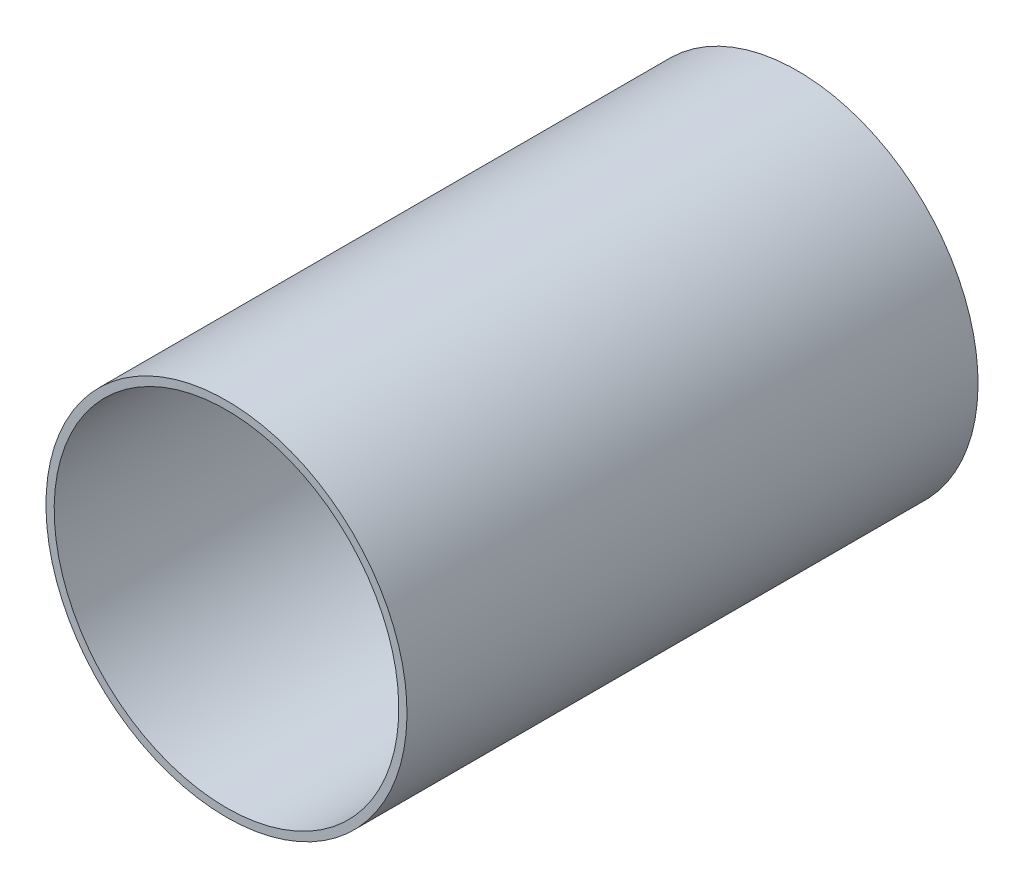
ISO-10303-21;
HEADER;
FILE_DESCRIPTION(('STEP AP214'),'2;1');
FILE_NAME('part.step','',(''),(''),'','','');
FILE_SCHEMA(('AUTOMOTIVE_DESIGN { 1 0 10303 214 1 1 1 1 }'));
ENDSEC;
DATA;
#1=APPLICATION_CONTEXT('core data for automotive mechanical design processes');
#2=APPLICATION_PROTOCOL_DEFINITION('international standard','automotive_design',2000,#1);
#3=PRODUCT_CONTEXT('',#1,'mechanical');
#4=PRODUCT('Part','Part','',(#3));
#5=PRODUCT_RELATED_PRODUCT_CATEGORY('part','',(#4));
#6=PRODUCT_DEFINITION_FORMATION('','',#4);
#7=PRODUCT_DEFINITION_CONTEXT('part definition',#1,'design');
#8=PRODUCT_DEFINITION('design','',#6,#7);
#9=PRODUCT_DEFINITION_SHAPE('','',#8);
#10=(LENGTH_UNIT() NAMED_UNIT(*) SI_UNIT(.MILLI.,.METRE.));
#11=(NAMED_UNIT(*) PLANE_ANGLE_UNIT() SI_UNIT($,.RADIAN.));
#12=(NAMED_UNIT(*) SI_UNIT($,.STERADIAN.) SOLID_ANGLE_UNIT());
#13=UNCERTAINTY_MEASURE_WITH_UNIT(LENGTH_MEASURE(1.E-05),#10,'distance_accuracy_value','');
#14=(GEOMETRIC_REPRESENTATION_CONTEXT(3) GLOBAL_UNCERTAINTY_ASSIGNED_CONTEXT((#13)) GLOBAL_UNIT_ASSIGNED_CONTEXT((#10,
#11,#12)) REPRESENTATION_CONTEXT('',''));
#15=CARTESIAN_POINT('',(0.,0.,0.));
#16=DIRECTION('',(0.,0.,1.));
#17=DIRECTION('',(1.,0.,0.));
#18=AXIS2_PLACEMENT_3D('',#15,#16,#17);
#19=CARTESIAN_POINT('',(149.102,-113.984,-0.045));
#20=DIRECTION('',(0.,0.,-1.));
#21=DIRECTION('',(0.,-1.,0.));
#22=AXIS2_PLACEMENT_3D('',#19,#20,#21);
#23=CYLINDRICAL_SURFACE('',#22,0.525);
#24=CARTESIAN_POINT('',(149.102,-113.984,-0.035));
#25=DIRECTION('',(0.,0.,-1.));
#26=DIRECTION('',(0.,-1.,0.));
#27=AXIS2_PLACEMENT_3D('',#24,#25,#26);
#28=CIRCLE('',#27,0.525);
#29=CARTESIAN_POINT('',(149.102,-114.509,-0.035));
#30=VERTEX_POINT('',#29);
#31=EDGE_CURVE('E64',#30,#30,#28,.T.);
#32=ORIENTED_EDGE('',*,*,#31,.T.);
#33=DIRECTION('',(0.,0.,1.));
#34=VECTOR('',#33,1.);
#35=CARTESIAN_POINT('',(149.102,-114.509,-0.045));
#36=LINE('',#35,#34);
#37=CARTESIAN_POINT('',(149.102,-114.509,1.705));
#38=VERTEX_POINT('',#37);
#39=EDGE_CURVE('E11',#30,#38,#36,.T.);
#40=ORIENTED_EDGE('',*,*,#39,.T.);
#41=CARTESIAN_POINT('',(149.102,-113.984,1.705));
#42=DIRECTION('',(0.,0.,-1.));
#43=DIRECTION('',(0.,-1.,0.));
#44=AXIS2_PLACEMENT_3D('',#41,#42,#43);
#45=CIRCLE('',#44,0.525);
#46=EDGE_CURVE('E25',#38,#38,#45,.T.);
#47=ORIENTED_EDGE('',*,*,#46,.F.);
#48=ORIENTED_EDGE('',*,*,#39,.F.);
#49=EDGE_LOOP('',(#32,#40,#47,#48));
#50=FACE_BOUND('',#49,.T.);
#51=ADVANCED_FACE('F17',(#50),#23,.F.);
#52=CARTESIAN_POINT('',(149.102,-114.534,1.705));
#53=DIRECTION('',(0.,0.,1.));
#54=DIRECTION('',(1.,0.,0.));
#55=AXIS2_PLACEMENT_3D('',#52,#53,#54);
#56=PLANE('',#55);
#57=ORIENTED_EDGE('',*,*,#46,.T.);
#58=EDGE_LOOP('',(#57));
#59=FACE_BOUND('',#58,.T.);
#60=CARTESIAN_POINT('',(149.102,-113.984,1.705));
#61=DIRECTION('',(0.,0.,1.));
#62=DIRECTION('',(0.,-1.,0.));
#63=AXIS2_PLACEMENT_3D('',#60,#61,#62);
#64=CIRCLE('',#63,0.55);
#65=CARTESIAN_POINT('',(149.102,-114.534,1.705));
#66=VERTEX_POINT('',#65);
#67=EDGE_CURVE('E56',#66,#66,#64,.T.);
#68=ORIENTED_EDGE('',*,*,#67,.T.);
#69=EDGE_LOOP('',(#68));
#70=FACE_BOUND('',#69,.T.);
#71=ADVANCED_FACE('F76',(#59,#70),#56,.T.);
#72=CARTESIAN_POINT('',(149.102,-114.534,-0.035));
#73=DIRECTION('',(0.,0.,1.));
#74=DIRECTION('',(1.,0.,0.));
#75=AXIS2_PLACEMENT_3D('',#72,#73,#74);
#76=PLANE('',#75);
#77=ORIENTED_EDGE('',*,*,#31,.F.);
#78=EDGE_LOOP('',(#77));
#79=FACE_BOUND('',#78,.T.);
#80=CARTESIAN_POINT('',(149.102,-113.984,-0.035));
#81=DIRECTION('',(0.,0.,1.));
#82=DIRECTION('',(0.,-1.,0.));
#83=AXIS2_PLACEMENT_3D('',#80,#81,#82);
#84=CIRCLE('',#83,0.55);
#85=CARTESIAN_POINT('',(149.102,-114.534,-0.035));
#86=VERTEX_POINT('',#85);
#87=EDGE_CURVE('E55',#86,#86,#84,.T.);
#88=ORIENTED_EDGE('',*,*,#87,.F.);
#89=EDGE_LOOP('',(#88));
#90=FACE_BOUND('',#89,.T.);
#91=ADVANCED_FACE('F84',(#79,#90),#76,.F.);
#92=CARTESIAN_POINT('',(149.102,-113.984,-0.035));
#93=DIRECTION('',(0.,0.,-1.));
#94=DIRECTION('',(0.,-1.,0.));
#95=AXIS2_PLACEMENT_3D('',#92,#93,#94);
#96=CYLINDRICAL_SURFACE('',#95,0.55);
#97=ORIENTED_EDGE('',*,*,#87,.T.);
#98=DIRECTION('',(0.,0.,1.));
#99=VECTOR('',#98,1.);
#100=CARTESIAN_POINT('',(149.102,-114.534,-0.035));
#101=LINE('',#100,#99);
#102=EDGE_CURVE('E52',#86,#66,#101,.T.);
#103=ORIENTED_EDGE('',*,*,#102,.T.);
#104=ORIENTED_EDGE('',*,*,#67,.F.);
#105=ORIENTED_EDGE('',*,*,#102,.F.);
#106=EDGE_LOOP('',(#97,#103,#104,#105));
#107=FACE_BOUND('',#106,.T.);
#108=ADVANCED_FACE('F53',(#107),#96,.T.);
#109=CLOSED_SHELL('',(#51,#71,#91,#108));
#110=MANIFOLD_SOLID_BREP('B1',#109);
#111=ADVANCED_BREP_SHAPE_REPRESENTATION('',(#18,#110),#14);
#112=SHAPE_DEFINITION_REPRESENTATION(#9,#111);
ENDSEC;
END-ISO-10303-21;
